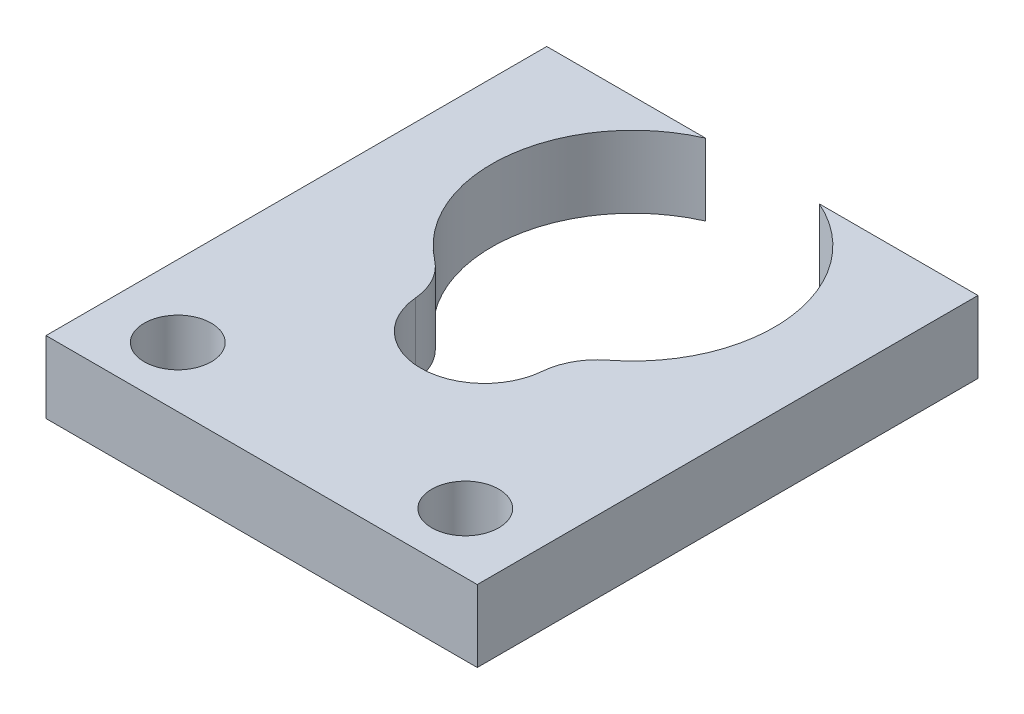
ISO-10303-21;
HEADER;
FILE_DESCRIPTION(('STEP AP214'),'2;1');
FILE_NAME('part.step','',(''),(''),'','','');
FILE_SCHEMA(('AUTOMOTIVE_DESIGN { 1 0 10303 214 1 1 1 1 }'));
ENDSEC;
DATA;
#1=APPLICATION_CONTEXT('core data for automotive mechanical design processes');
#2=APPLICATION_PROTOCOL_DEFINITION('international standard','automotive_design',2000,#1);
#3=PRODUCT_CONTEXT('',#1,'mechanical');
#4=PRODUCT('Part','Part','',(#3));
#5=PRODUCT_RELATED_PRODUCT_CATEGORY('part','',(#4));
#6=PRODUCT_DEFINITION_FORMATION('','',#4);
#7=PRODUCT_DEFINITION_CONTEXT('part definition',#1,'design');
#8=PRODUCT_DEFINITION('design','',#6,#7);
#9=PRODUCT_DEFINITION_SHAPE('','',#8);
#10=(LENGTH_UNIT() NAMED_UNIT(*) SI_UNIT(.MILLI.,.METRE.));
#11=(NAMED_UNIT(*) PLANE_ANGLE_UNIT() SI_UNIT($,.RADIAN.));
#12=(NAMED_UNIT(*) SI_UNIT($,.STERADIAN.) SOLID_ANGLE_UNIT());
#13=UNCERTAINTY_MEASURE_WITH_UNIT(LENGTH_MEASURE(1.E-05),#10,'distance_accuracy_value','');
#14=(GEOMETRIC_REPRESENTATION_CONTEXT(3) GLOBAL_UNCERTAINTY_ASSIGNED_CONTEXT((#13)) GLOBAL_UNIT_ASSIGNED_CONTEXT((#10,
#11,#12)) REPRESENTATION_CONTEXT('',''));
#15=CARTESIAN_POINT('',(0.,0.,0.));
#16=DIRECTION('',(0.,0.,1.));
#17=DIRECTION('',(1.,0.,0.));
#18=AXIS2_PLACEMENT_3D('',#15,#16,#17);
#19=CARTESIAN_POINT('',(0.,3.,0.));
#20=DIRECTION('',(0.,1.,0.));
#21=DIRECTION('',(0.,0.,1.));
#22=AXIS2_PLACEMENT_3D('',#19,#20,#21);
#23=PLANE('',#22);
#24=CARTESIAN_POINT('',(-6.,3.,13.));
#25=DIRECTION('',(0.,1.,0.));
#26=DIRECTION('',(0.,0.,1.));
#27=AXIS2_PLACEMENT_3D('',#24,#25,#26);
#28=CIRCLE('',#27,1.4);
#29=CARTESIAN_POINT('',(-6.,3.,14.4));
#30=VERTEX_POINT('',#29);
#31=EDGE_CURVE('E152',#30,#30,#28,.T.);
#32=ORIENTED_EDGE('',*,*,#31,.F.);
#33=EDGE_LOOP('',(#32));
#34=FACE_BOUND('',#33,.T.);
#35=DIRECTION('',(0.,0.,1.));
#36=VECTOR('',#35,1.);
#37=CARTESIAN_POINT('',(-9.,3.,-5.4));
#38=LINE('',#37,#36);
#39=CARTESIAN_POINT('',(-9.,3.,-5.4));
#40=VERTEX_POINT('',#39);
#41=CARTESIAN_POINT('',(-9.,3.,15.5));
#42=VERTEX_POINT('',#41);
#43=EDGE_CURVE('E167',#40,#42,#38,.T.);
#44=ORIENTED_EDGE('',*,*,#43,.T.);
#45=DIRECTION('',(1.,0.,0.));
#46=VECTOR('',#45,1.);
#47=CARTESIAN_POINT('',(-9.,3.,15.5));
#48=LINE('',#47,#46);
#49=CARTESIAN_POINT('',(9.,3.,15.5));
#50=VERTEX_POINT('',#49);
#51=EDGE_CURVE('E105',#42,#50,#48,.T.);
#52=ORIENTED_EDGE('',*,*,#51,.T.);
#53=DIRECTION('',(0.,0.,-1.));
#54=VECTOR('',#53,1.);
#55=CARTESIAN_POINT('',(9.,3.,-5.4));
#56=LINE('',#55,#54);
#57=CARTESIAN_POINT('',(9.,3.,-5.4));
#58=VERTEX_POINT('',#57);
#59=EDGE_CURVE('E188',#50,#58,#56,.T.);
#60=ORIENTED_EDGE('',*,*,#59,.T.);
#61=DIRECTION('',(-1.,0.,0.));
#62=VECTOR('',#61,1.);
#63=CARTESIAN_POINT('',(2.37697286480094,3.,-5.4));
#64=LINE('',#63,#62);
#65=CARTESIAN_POINT('',(2.37697286480094,3.,-5.4));
#66=VERTEX_POINT('',#65);
#67=EDGE_CURVE('E207',#58,#66,#64,.T.);
#68=ORIENTED_EDGE('',*,*,#67,.T.);
#69=CARTESIAN_POINT('',(0.,3.,0.));
#70=DIRECTION('',(0.,-1.,0.));
#71=DIRECTION('',(0.,0.,1.));
#72=AXIS2_PLACEMENT_3D('',#69,#70,#71);
#73=CIRCLE('',#72,5.9);
#74=CARTESIAN_POINT('',(3.61077127583088,3.,4.66608302472584));
#75=VERTEX_POINT('',#74);
#76=EDGE_CURVE('E204',#66,#75,#73,.T.);
#77=ORIENTED_EDGE('',*,*,#76,.T.);
#78=CARTESIAN_POINT('',(5.14075910457277,3.,6.64323684876222));
#79=DIRECTION('',(0.,1.,0.));
#80=DIRECTION('',(0.,0.,-1.));
#81=AXIS2_PLACEMENT_3D('',#78,#79,#80);
#82=CIRCLE('',#81,2.5);
#83=CARTESIAN_POINT('',(2.65,3.,6.42848330865671));
#84=VERTEX_POINT('',#83);
#85=EDGE_CURVE('E206',#75,#84,#82,.T.);
#86=ORIENTED_EDGE('',*,*,#85,.T.);
#87=CARTESIAN_POINT('',(0.,3.,6.2));
#88=DIRECTION('',(0.,-1.,0.));
#89=DIRECTION('',(0.,0.,1.));
#90=AXIS2_PLACEMENT_3D('',#87,#88,#89);
#91=CIRCLE('',#90,2.65983169060276);
#92=CARTESIAN_POINT('',(-2.65,3.,6.42848330865671));
#93=VERTEX_POINT('',#92);
#94=EDGE_CURVE('E130',#84,#93,#91,.T.);
#95=ORIENTED_EDGE('',*,*,#94,.T.);
#96=CARTESIAN_POINT('',(-5.14075910457277,3.,6.64323684876222));
#97=DIRECTION('',(0.,1.,0.));
#98=DIRECTION('',(0.,0.,1.));
#99=AXIS2_PLACEMENT_3D('',#96,#97,#98);
#100=CIRCLE('',#99,2.5);
#101=CARTESIAN_POINT('',(-3.61077127583087,3.,4.66608302472584));
#102=VERTEX_POINT('',#101);
#103=EDGE_CURVE('E124',#93,#102,#100,.T.);
#104=ORIENTED_EDGE('',*,*,#103,.T.);
#105=CARTESIAN_POINT('',(0.,3.,0.));
#106=DIRECTION('',(0.,-1.,0.));
#107=DIRECTION('',(0.,0.,1.));
#108=AXIS2_PLACEMENT_3D('',#105,#106,#107);
#109=CIRCLE('',#108,5.9);
#110=CARTESIAN_POINT('',(-2.37697286480094,3.,-5.4));
#111=VERTEX_POINT('',#110);
#112=EDGE_CURVE('E128',#102,#111,#109,.T.);
#113=ORIENTED_EDGE('',*,*,#112,.T.);
#114=DIRECTION('',(-1.,0.,0.));
#115=VECTOR('',#114,1.);
#116=CARTESIAN_POINT('',(-9.,3.,-5.4));
#117=LINE('',#116,#115);
#118=EDGE_CURVE('E56',#111,#40,#117,.T.);
#119=ORIENTED_EDGE('',*,*,#118,.T.);
#120=EDGE_LOOP('',(#44,#52,#60,#68,#77,#86,#95,#104,#113,#119));
#121=FACE_BOUND('',#120,.T.);
#122=CARTESIAN_POINT('',(6.,3.,13.));
#123=DIRECTION('',(0.,1.,0.));
#124=DIRECTION('',(0.,0.,1.));
#125=AXIS2_PLACEMENT_3D('',#122,#123,#124);
#126=CIRCLE('',#125,1.4);
#127=CARTESIAN_POINT('',(6.,3.,14.4));
#128=VERTEX_POINT('',#127);
#129=EDGE_CURVE('E218',#128,#128,#126,.T.);
#130=ORIENTED_EDGE('',*,*,#129,.F.);
#131=EDGE_LOOP('',(#130));
#132=FACE_BOUND('',#131,.T.);
#133=ADVANCED_FACE('F39',(#34,#121,#132),#23,.T.);
#134=CARTESIAN_POINT('',(0.,0.,0.));
#135=DIRECTION('',(0.,1.,0.));
#136=DIRECTION('',(0.,0.,1.));
#137=AXIS2_PLACEMENT_3D('',#134,#135,#136);
#138=PLANE('',#137);
#139=DIRECTION('',(0.,0.,1.));
#140=VECTOR('',#139,1.);
#141=CARTESIAN_POINT('',(-9.,0.,-5.4));
#142=LINE('',#141,#140);
#143=CARTESIAN_POINT('',(-9.,0.,-5.4));
#144=VERTEX_POINT('',#143);
#145=CARTESIAN_POINT('',(-9.,0.,15.5));
#146=VERTEX_POINT('',#145);
#147=EDGE_CURVE('E148',#144,#146,#142,.T.);
#148=ORIENTED_EDGE('',*,*,#147,.F.);
#149=DIRECTION('',(-1.,0.,0.));
#150=VECTOR('',#149,1.);
#151=CARTESIAN_POINT('',(-9.,0.,-5.4));
#152=LINE('',#151,#150);
#153=CARTESIAN_POINT('',(-2.37697286480094,0.,-5.4));
#154=VERTEX_POINT('',#153);
#155=EDGE_CURVE('E97',#154,#144,#152,.T.);
#156=ORIENTED_EDGE('',*,*,#155,.F.);
#157=CARTESIAN_POINT('',(0.,0.,0.));
#158=DIRECTION('',(0.,-1.,0.));
#159=DIRECTION('',(0.,0.,1.));
#160=AXIS2_PLACEMENT_3D('',#157,#158,#159);
#161=CIRCLE('',#160,5.9);
#162=CARTESIAN_POINT('',(-3.61077127583087,0.,4.66608302472584));
#163=VERTEX_POINT('',#162);
#164=EDGE_CURVE('E91',#163,#154,#161,.T.);
#165=ORIENTED_EDGE('',*,*,#164,.F.);
#166=CARTESIAN_POINT('',(-5.14075910457277,0.,6.64323684876222));
#167=DIRECTION('',(0.,1.,0.));
#168=DIRECTION('',(0.,0.,1.));
#169=AXIS2_PLACEMENT_3D('',#166,#167,#168);
#170=CIRCLE('',#169,2.5);
#171=CARTESIAN_POINT('',(-2.65,0.,6.42848330865671));
#172=VERTEX_POINT('',#171);
#173=EDGE_CURVE('E138',#172,#163,#170,.T.);
#174=ORIENTED_EDGE('',*,*,#173,.F.);
#175=CARTESIAN_POINT('',(0.,0.,6.2));
#176=DIRECTION('',(0.,-1.,0.));
#177=DIRECTION('',(0.,0.,1.));
#178=AXIS2_PLACEMENT_3D('',#175,#176,#177);
#179=CIRCLE('',#178,2.65983169060276);
#180=CARTESIAN_POINT('',(2.65,0.,6.42848330865671));
#181=VERTEX_POINT('',#180);
#182=EDGE_CURVE('E162',#181,#172,#179,.T.);
#183=ORIENTED_EDGE('',*,*,#182,.F.);
#184=CARTESIAN_POINT('',(5.14075910457277,0.,6.64323684876222));
#185=DIRECTION('',(0.,1.,0.));
#186=DIRECTION('',(0.,0.,-1.));
#187=AXIS2_PLACEMENT_3D('',#184,#185,#186);
#188=CIRCLE('',#187,2.5);
#189=CARTESIAN_POINT('',(3.61077127583088,0.,4.66608302472584));
#190=VERTEX_POINT('',#189);
#191=EDGE_CURVE('E160',#190,#181,#188,.T.);
#192=ORIENTED_EDGE('',*,*,#191,.F.);
#193=CARTESIAN_POINT('',(0.,0.,0.));
#194=DIRECTION('',(0.,-1.,0.));
#195=DIRECTION('',(0.,0.,1.));
#196=AXIS2_PLACEMENT_3D('',#193,#194,#195);
#197=CIRCLE('',#196,5.9);
#198=CARTESIAN_POINT('',(2.37697286480094,0.,-5.4));
#199=VERTEX_POINT('',#198);
#200=EDGE_CURVE('E158',#199,#190,#197,.T.);
#201=ORIENTED_EDGE('',*,*,#200,.F.);
#202=DIRECTION('',(-1.,0.,0.));
#203=VECTOR('',#202,1.);
#204=CARTESIAN_POINT('',(2.37697286480094,0.,-5.4));
#205=LINE('',#204,#203);
#206=CARTESIAN_POINT('',(9.,0.,-5.4));
#207=VERTEX_POINT('',#206);
#208=EDGE_CURVE('E156',#207,#199,#205,.T.);
#209=ORIENTED_EDGE('',*,*,#208,.F.);
#210=DIRECTION('',(0.,0.,-1.));
#211=VECTOR('',#210,1.);
#212=CARTESIAN_POINT('',(9.,0.,-5.4));
#213=LINE('',#212,#211);
#214=CARTESIAN_POINT('',(9.,0.,15.5));
#215=VERTEX_POINT('',#214);
#216=EDGE_CURVE('E154',#215,#207,#213,.T.);
#217=ORIENTED_EDGE('',*,*,#216,.F.);
#218=DIRECTION('',(1.,0.,0.));
#219=VECTOR('',#218,1.);
#220=CARTESIAN_POINT('',(-9.,0.,15.5));
#221=LINE('',#220,#219);
#222=EDGE_CURVE('E151',#146,#215,#221,.T.);
#223=ORIENTED_EDGE('',*,*,#222,.F.);
#224=EDGE_LOOP('',(#148,#156,#165,#174,#183,#192,#201,#209,#217,#223));
#225=FACE_BOUND('',#224,.T.);
#226=CARTESIAN_POINT('',(-6.,0.,13.));
#227=DIRECTION('',(0.,1.,0.));
#228=DIRECTION('',(0.,0.,1.));
#229=AXIS2_PLACEMENT_3D('',#226,#227,#228);
#230=CIRCLE('',#229,1.4);
#231=CARTESIAN_POINT('',(-6.,0.,14.4));
#232=VERTEX_POINT('',#231);
#233=EDGE_CURVE('E215',#232,#232,#230,.T.);
#234=ORIENTED_EDGE('',*,*,#233,.T.);
#235=EDGE_LOOP('',(#234));
#236=FACE_BOUND('',#235,.T.);
#237=CARTESIAN_POINT('',(6.,0.,13.));
#238=DIRECTION('',(0.,1.,0.));
#239=DIRECTION('',(0.,0.,1.));
#240=AXIS2_PLACEMENT_3D('',#237,#238,#239);
#241=CIRCLE('',#240,1.4);
#242=CARTESIAN_POINT('',(6.,0.,14.4));
#243=VERTEX_POINT('',#242);
#244=EDGE_CURVE('E221',#243,#243,#241,.T.);
#245=ORIENTED_EDGE('',*,*,#244,.T.);
#246=EDGE_LOOP('',(#245));
#247=FACE_BOUND('',#246,.T.);
#248=ADVANCED_FACE('F192',(#225,#236,#247),#138,.F.);
#249=CARTESIAN_POINT('',(-9.,3.,-5.4));
#250=DIRECTION('',(1.,0.,0.));
#251=DIRECTION('',(0.,0.,-1.));
#252=AXIS2_PLACEMENT_3D('',#249,#250,#251);
#253=PLANE('',#252);
#254=ORIENTED_EDGE('',*,*,#147,.T.);
#255=DIRECTION('',(0.,-1.,0.));
#256=VECTOR('',#255,1.);
#257=CARTESIAN_POINT('',(-9.,3.,15.5));
#258=LINE('',#257,#256);
#259=EDGE_CURVE('E11',#42,#146,#258,.T.);
#260=ORIENTED_EDGE('',*,*,#259,.F.);
#261=ORIENTED_EDGE('',*,*,#43,.F.);
#262=DIRECTION('',(0.,-1.,0.));
#263=VECTOR('',#262,1.);
#264=CARTESIAN_POINT('',(-9.,3.,-5.4));
#265=LINE('',#264,#263);
#266=EDGE_CURVE('E144',#40,#144,#265,.T.);
#267=ORIENTED_EDGE('',*,*,#266,.T.);
#268=EDGE_LOOP('',(#254,#260,#261,#267));
#269=FACE_BOUND('',#268,.T.);
#270=ADVANCED_FACE('F41',(#269),#253,.F.);
#271=CARTESIAN_POINT('',(-9.,3.,15.5));
#272=DIRECTION('',(0.,0.,-1.));
#273=DIRECTION('',(-1.,0.,0.));
#274=AXIS2_PLACEMENT_3D('',#271,#272,#273);
#275=PLANE('',#274);
#276=ORIENTED_EDGE('',*,*,#222,.T.);
#277=DIRECTION('',(0.,-1.,0.));
#278=VECTOR('',#277,1.);
#279=CARTESIAN_POINT('',(9.,3.,15.5));
#280=LINE('',#279,#278);
#281=EDGE_CURVE('E48',#50,#215,#280,.T.);
#282=ORIENTED_EDGE('',*,*,#281,.F.);
#283=ORIENTED_EDGE('',*,*,#51,.F.);
#284=ORIENTED_EDGE('',*,*,#259,.T.);
#285=EDGE_LOOP('',(#276,#282,#283,#284));
#286=FACE_BOUND('',#285,.T.);
#287=ADVANCED_FACE('F261',(#286),#275,.F.);
#288=CARTESIAN_POINT('',(9.,3.,-5.4));
#289=DIRECTION('',(-1.,0.,0.));
#290=DIRECTION('',(0.,0.,1.));
#291=AXIS2_PLACEMENT_3D('',#288,#289,#290);
#292=PLANE('',#291);
#293=ORIENTED_EDGE('',*,*,#216,.T.);
#294=DIRECTION('',(0.,-1.,0.));
#295=VECTOR('',#294,1.);
#296=CARTESIAN_POINT('',(9.,3.,-5.4));
#297=LINE('',#296,#295);
#298=EDGE_CURVE('E180',#58,#207,#297,.T.);
#299=ORIENTED_EDGE('',*,*,#298,.F.);
#300=ORIENTED_EDGE('',*,*,#59,.F.);
#301=ORIENTED_EDGE('',*,*,#281,.T.);
#302=EDGE_LOOP('',(#293,#299,#300,#301));
#303=FACE_BOUND('',#302,.T.);
#304=ADVANCED_FACE('F186',(#303),#292,.F.);
#305=CARTESIAN_POINT('',(2.37697286480094,3.,-5.4));
#306=DIRECTION('',(0.,0.,1.));
#307=DIRECTION('',(1.,0.,0.));
#308=AXIS2_PLACEMENT_3D('',#305,#306,#307);
#309=PLANE('',#308);
#310=ORIENTED_EDGE('',*,*,#208,.T.);
#311=DIRECTION('',(0.,-1.,0.));
#312=VECTOR('',#311,1.);
#313=CARTESIAN_POINT('',(2.37697286480094,3.,-5.4));
#314=LINE('',#313,#312);
#315=EDGE_CURVE('E177',#66,#199,#314,.T.);
#316=ORIENTED_EDGE('',*,*,#315,.F.);
#317=ORIENTED_EDGE('',*,*,#67,.F.);
#318=ORIENTED_EDGE('',*,*,#298,.T.);
#319=EDGE_LOOP('',(#310,#316,#317,#318));
#320=FACE_BOUND('',#319,.T.);
#321=ADVANCED_FACE('F198',(#320),#309,.F.);
#322=CARTESIAN_POINT('',(0.,3.,0.));
#323=DIRECTION('',(0.,-1.,0.));
#324=DIRECTION('',(0.,0.,-1.));
#325=AXIS2_PLACEMENT_3D('',#322,#323,#324);
#326=CYLINDRICAL_SURFACE('',#325,5.9);
#327=ORIENTED_EDGE('',*,*,#200,.T.);
#328=DIRECTION('',(0.,-1.,0.));
#329=VECTOR('',#328,1.);
#330=CARTESIAN_POINT('',(3.61077127583088,3.,4.66608302472584));
#331=LINE('',#330,#329);
#332=EDGE_CURVE('E174',#75,#190,#331,.T.);
#333=ORIENTED_EDGE('',*,*,#332,.F.);
#334=ORIENTED_EDGE('',*,*,#76,.F.);
#335=ORIENTED_EDGE('',*,*,#315,.T.);
#336=EDGE_LOOP('',(#327,#333,#334,#335));
#337=FACE_BOUND('',#336,.T.);
#338=ADVANCED_FACE('F202',(#337),#326,.F.);
#339=CARTESIAN_POINT('',(5.14075910457277,3.,6.64323684876222));
#340=DIRECTION('',(0.,-1.,0.));
#341=DIRECTION('',(0.,0.,-1.));
#342=AXIS2_PLACEMENT_3D('',#339,#340,#341);
#343=CYLINDRICAL_SURFACE('',#342,2.5);
#344=ORIENTED_EDGE('',*,*,#191,.T.);
#345=DIRECTION('',(0.,-1.,0.));
#346=VECTOR('',#345,1.);
#347=CARTESIAN_POINT('',(2.65,3.,6.42848330865671));
#348=LINE('',#347,#346);
#349=EDGE_CURVE('E171',#84,#181,#348,.T.);
#350=ORIENTED_EDGE('',*,*,#349,.F.);
#351=ORIENTED_EDGE('',*,*,#85,.F.);
#352=ORIENTED_EDGE('',*,*,#332,.T.);
#353=EDGE_LOOP('',(#344,#350,#351,#352));
#354=FACE_BOUND('',#353,.T.);
#355=ADVANCED_FACE('F251',(#354),#343,.T.);
#356=CARTESIAN_POINT('',(0.,3.,6.2));
#357=DIRECTION('',(0.,-1.,0.));
#358=DIRECTION('',(0.,0.,-1.));
#359=AXIS2_PLACEMENT_3D('',#356,#357,#358);
#360=CYLINDRICAL_SURFACE('',#359,2.65983169060276);
#361=ORIENTED_EDGE('',*,*,#182,.T.);
#362=DIRECTION('',(0.,-1.,0.));
#363=VECTOR('',#362,1.);
#364=CARTESIAN_POINT('',(-2.65,3.,6.42848330865671));
#365=LINE('',#364,#363);
#366=EDGE_CURVE('E139',#93,#172,#365,.T.);
#367=ORIENTED_EDGE('',*,*,#366,.F.);
#368=ORIENTED_EDGE('',*,*,#94,.F.);
#369=ORIENTED_EDGE('',*,*,#349,.T.);
#370=EDGE_LOOP('',(#361,#367,#368,#369));
#371=FACE_BOUND('',#370,.T.);
#372=ADVANCED_FACE('F248',(#371),#360,.F.);
#373=CARTESIAN_POINT('',(-5.14075910457277,3.,6.64323684876222));
#374=DIRECTION('',(0.,-1.,0.));
#375=DIRECTION('',(0.,0.,-1.));
#376=AXIS2_PLACEMENT_3D('',#373,#374,#375);
#377=CYLINDRICAL_SURFACE('',#376,2.5);
#378=ORIENTED_EDGE('',*,*,#173,.T.);
#379=DIRECTION('',(0.,-1.,0.));
#380=VECTOR('',#379,1.);
#381=CARTESIAN_POINT('',(-3.61077127583087,3.,4.66608302472584));
#382=LINE('',#381,#380);
#383=EDGE_CURVE('E135',#102,#163,#382,.T.);
#384=ORIENTED_EDGE('',*,*,#383,.F.);
#385=ORIENTED_EDGE('',*,*,#103,.F.);
#386=ORIENTED_EDGE('',*,*,#366,.T.);
#387=EDGE_LOOP('',(#378,#384,#385,#386));
#388=FACE_BOUND('',#387,.T.);
#389=ADVANCED_FACE('F136',(#388),#377,.T.);
#390=CARTESIAN_POINT('',(0.,3.,0.));
#391=DIRECTION('',(0.,-1.,0.));
#392=DIRECTION('',(0.,0.,-1.));
#393=AXIS2_PLACEMENT_3D('',#390,#391,#392);
#394=CYLINDRICAL_SURFACE('',#393,5.9);
#395=ORIENTED_EDGE('',*,*,#164,.T.);
#396=DIRECTION('',(0.,-1.,0.));
#397=VECTOR('',#396,1.);
#398=CARTESIAN_POINT('',(-2.37697286480094,3.,-5.4));
#399=LINE('',#398,#397);
#400=EDGE_CURVE('E140',#111,#154,#399,.T.);
#401=ORIENTED_EDGE('',*,*,#400,.F.);
#402=ORIENTED_EDGE('',*,*,#112,.F.);
#403=ORIENTED_EDGE('',*,*,#383,.T.);
#404=EDGE_LOOP('',(#395,#401,#402,#403));
#405=FACE_BOUND('',#404,.T.);
#406=ADVANCED_FACE('F142',(#405),#394,.F.);
#407=CARTESIAN_POINT('',(-9.,3.,-5.4));
#408=DIRECTION('',(0.,0.,1.));
#409=DIRECTION('',(1.,0.,0.));
#410=AXIS2_PLACEMENT_3D('',#407,#408,#409);
#411=PLANE('',#410);
#412=ORIENTED_EDGE('',*,*,#155,.T.);
#413=ORIENTED_EDGE('',*,*,#266,.F.);
#414=ORIENTED_EDGE('',*,*,#118,.F.);
#415=ORIENTED_EDGE('',*,*,#400,.T.);
#416=EDGE_LOOP('',(#412,#413,#414,#415));
#417=FACE_BOUND('',#416,.T.);
#418=ADVANCED_FACE('F241',(#417),#411,.F.);
#419=CARTESIAN_POINT('',(-6.,3.,13.));
#420=DIRECTION('',(0.,-1.,0.));
#421=DIRECTION('',(0.,0.,-1.));
#422=AXIS2_PLACEMENT_3D('',#419,#420,#421);
#423=CYLINDRICAL_SURFACE('',#422,1.4);
#424=ORIENTED_EDGE('',*,*,#31,.T.);
#425=EDGE_LOOP('',(#424));
#426=FACE_BOUND('',#425,.T.);
#427=ORIENTED_EDGE('',*,*,#233,.F.);
#428=EDGE_LOOP('',(#427));
#429=FACE_BOUND('',#428,.T.);
#430=ADVANCED_FACE('F238',(#426,#429),#423,.F.);
#431=CARTESIAN_POINT('',(6.,3.,13.));
#432=DIRECTION('',(0.,-1.,0.));
#433=DIRECTION('',(0.,0.,-1.));
#434=AXIS2_PLACEMENT_3D('',#431,#432,#433);
#435=CYLINDRICAL_SURFACE('',#434,1.4);
#436=ORIENTED_EDGE('',*,*,#129,.T.);
#437=EDGE_LOOP('',(#436));
#438=FACE_BOUND('',#437,.T.);
#439=ORIENTED_EDGE('',*,*,#244,.F.);
#440=EDGE_LOOP('',(#439));
#441=FACE_BOUND('',#440,.T.);
#442=ADVANCED_FACE('F227',(#438,#441),#435,.F.);
#443=CLOSED_SHELL('',(#133,#248,#270,#287,#304,#321,#338,#355,#372,#389,#406,#418,#430,#442));
#444=MANIFOLD_SOLID_BREP('B2',#443);
#445=ADVANCED_BREP_SHAPE_REPRESENTATION('',(#18,#444),#14);
#446=SHAPE_DEFINITION_REPRESENTATION(#9,#445);
ENDSEC;
END-ISO-10303-21;
